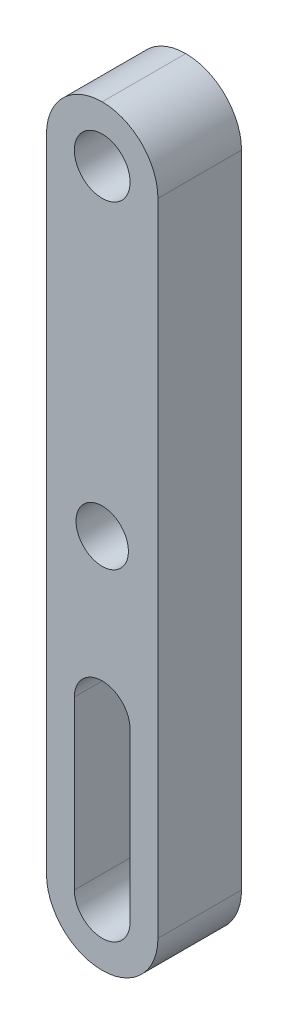
ISO-10303-21;
HEADER;
FILE_DESCRIPTION(('STEP AP214'),'2;1');
FILE_NAME('part.step','',(''),(''),'','','');
FILE_SCHEMA(('AUTOMOTIVE_DESIGN { 1 0 10303 214 1 1 1 1 }'));
ENDSEC;
DATA;
#1=APPLICATION_CONTEXT('core data for automotive mechanical design processes');
#2=APPLICATION_PROTOCOL_DEFINITION('international standard','automotive_design',2000,#1);
#3=PRODUCT_CONTEXT('',#1,'mechanical');
#4=PRODUCT('Part','Part','',(#3));
#5=PRODUCT_RELATED_PRODUCT_CATEGORY('part','',(#4));
#6=PRODUCT_DEFINITION_FORMATION('','',#4);
#7=PRODUCT_DEFINITION_CONTEXT('part definition',#1,'design');
#8=PRODUCT_DEFINITION('design','',#6,#7);
#9=PRODUCT_DEFINITION_SHAPE('','',#8);
#10=(LENGTH_UNIT() NAMED_UNIT(*) SI_UNIT(.MILLI.,.METRE.));
#11=(NAMED_UNIT(*) PLANE_ANGLE_UNIT() SI_UNIT($,.RADIAN.));
#12=(NAMED_UNIT(*) SI_UNIT($,.STERADIAN.) SOLID_ANGLE_UNIT());
#13=UNCERTAINTY_MEASURE_WITH_UNIT(LENGTH_MEASURE(1.E-05),#10,'distance_accuracy_value','');
#14=(GEOMETRIC_REPRESENTATION_CONTEXT(3) GLOBAL_UNCERTAINTY_ASSIGNED_CONTEXT((#13)) GLOBAL_UNIT_ASSIGNED_CONTEXT((#10,
#11,#12)) REPRESENTATION_CONTEXT('',''));
#15=CARTESIAN_POINT('',(0.,0.,0.));
#16=DIRECTION('',(0.,0.,1.));
#17=DIRECTION('',(1.,0.,0.));
#18=AXIS2_PLACEMENT_3D('',#15,#16,#17);
#19=CARTESIAN_POINT('',(-3.17500000000003,21.4312500000002,4.76249999999993));
#20=DIRECTION('',(1.00000000000001,0.,0.));
#21=DIRECTION('',(0.,0.,-1.));
#22=AXIS2_PLACEMENT_3D('',#19,#20,#21);
#23=PLANE('',#22);
#24=DIRECTION('',(0.,-1.00000000000001,0.));
#25=VECTOR('',#24,1.);
#26=CARTESIAN_POINT('',(-3.175,21.4312500000001,2.35922392732846E-13));
#27=LINE('',#26,#25);
#28=CARTESIAN_POINT('',(-3.17500000000004,18.25625,2.70616862252382E-13));
#29=VERTEX_POINT('',#28);
#30=CARTESIAN_POINT('',(-3.17500000000016,-18.2562500000003,1.38777878078145E-13));
#31=VERTEX_POINT('',#30);
#32=EDGE_CURVE('E184',#29,#31,#27,.T.);
#33=ORIENTED_EDGE('',*,*,#32,.T.);
#34=DIRECTION('',(0.,0.,-1.));
#35=VECTOR('',#34,1.);
#36=CARTESIAN_POINT('',(-3.17500000000018,-18.2562500000002,4.76249999999984));
#37=LINE('',#36,#35);
#38=CARTESIAN_POINT('',(-3.17500000000018,-18.2562500000002,4.76249999999984));
#39=VERTEX_POINT('',#38);
#40=EDGE_CURVE('E217',#31,#39,#37,.F.);
#41=ORIENTED_EDGE('',*,*,#40,.T.);
#42=DIRECTION('',(0.,-1.00000000000001,0.));
#43=VECTOR('',#42,1.);
#44=CARTESIAN_POINT('',(-3.17500000000003,21.4312500000002,4.76249999999993));
#45=LINE('',#44,#43);
#46=CARTESIAN_POINT('',(-3.17500000000004,18.2562500000002,4.76249999999997));
#47=VERTEX_POINT('',#46);
#48=EDGE_CURVE('E188',#47,#39,#45,.T.);
#49=ORIENTED_EDGE('',*,*,#48,.F.);
#50=DIRECTION('',(0.,0.,-1.));
#51=VECTOR('',#50,1.);
#52=CARTESIAN_POINT('',(-3.17500000000004,18.2562500000002,4.76249999999997));
#53=LINE('',#52,#51);
#54=EDGE_CURVE('E213',#47,#29,#53,.T.);
#55=ORIENTED_EDGE('',*,*,#54,.T.);
#56=EDGE_LOOP('',(#33,#41,#49,#55));
#57=FACE_BOUND('',#56,.T.);
#58=ADVANCED_FACE('F34',(#57),#23,.F.);
#59=CARTESIAN_POINT('',(3.17500000000005,21.4312500000002,4.76249999999997));
#60=DIRECTION('',(-1.00000000000001,0.,0.));
#61=DIRECTION('',(0.,0.,1.));
#62=AXIS2_PLACEMENT_3D('',#59,#60,#61);
#63=PLANE('',#62);
#64=DIRECTION('',(0.,1.00000000000001,0.));
#65=VECTOR('',#64,1.);
#66=CARTESIAN_POINT('',(3.17500000000005,21.4312500000002,4.76249999999997));
#67=LINE('',#66,#65);
#68=CARTESIAN_POINT('',(3.17499999999998,-18.2562500000002,4.76250000000029));
#69=VERTEX_POINT('',#68);
#70=CARTESIAN_POINT('',(3.17500000000003,18.2562500000003,4.76250000000007));
#71=VERTEX_POINT('',#70);
#72=EDGE_CURVE('E192',#69,#71,#67,.T.);
#73=ORIENTED_EDGE('',*,*,#72,.F.);
#74=DIRECTION('',(0.,0.,-1.));
#75=VECTOR('',#74,1.);
#76=CARTESIAN_POINT('',(3.17499999999998,-18.2562500000002,4.76250000000029));
#77=LINE('',#76,#75);
#78=CARTESIAN_POINT('',(3.17499999999998,-18.2562500000003,-2.28983498828939E-13));
#79=VERTEX_POINT('',#78);
#80=EDGE_CURVE('E11',#69,#79,#77,.T.);
#81=ORIENTED_EDGE('',*,*,#80,.T.);
#82=DIRECTION('',(0.,1.00000000000001,0.));
#83=VECTOR('',#82,1.);
#84=CARTESIAN_POINT('',(3.17500000000019,21.4312500000002,0.));
#85=LINE('',#84,#83);
#86=CARTESIAN_POINT('',(3.17500000000009,18.2562500000002,1.73472347597681E-13));
#87=VERTEX_POINT('',#86);
#88=EDGE_CURVE('E193',#79,#87,#85,.T.);
#89=ORIENTED_EDGE('',*,*,#88,.T.);
#90=DIRECTION('',(0.,0.,-1.));
#91=VECTOR('',#90,1.);
#92=CARTESIAN_POINT('',(3.17500000000003,18.2562500000003,4.76250000000007));
#93=LINE('',#92,#91);
#94=EDGE_CURVE('E44',#87,#71,#93,.F.);
#95=ORIENTED_EDGE('',*,*,#94,.T.);
#96=EDGE_LOOP('',(#73,#81,#89,#95));
#97=FACE_BOUND('',#96,.T.);
#98=ADVANCED_FACE('F252',(#97),#63,.F.);
#99=CARTESIAN_POINT('',(0.,0.,4.76250000000016));
#100=DIRECTION('',(0.,0.,1.));
#101=DIRECTION('',(1.00000000000001,0.,0.));
#102=AXIS2_PLACEMENT_3D('',#99,#100,#101);
#103=PLANE('',#102);
#104=CARTESIAN_POINT('',(-1.80411241501588E-13,-18.2562500000003,4.76250000000007));
#105=DIRECTION('',(0.,0.,1.));
#106=DIRECTION('',(1.00000000000001,0.,0.));
#107=AXIS2_PLACEMENT_3D('',#104,#105,#106);
#108=CIRCLE('',#107,1.5875);
#109=CARTESIAN_POINT('',(-1.58750000000013,-18.2562500000002,4.76250000000002));
#110=VERTEX_POINT('',#109);
#111=CARTESIAN_POINT('',(1.58749999999989,-18.2562500000002,4.76249999999994));
#112=VERTEX_POINT('',#111);
#113=EDGE_CURVE('E121',#110,#112,#108,.T.);
#114=ORIENTED_EDGE('',*,*,#113,.F.);
#115=DIRECTION('',(0.,-1.00000000000001,0.));
#116=VECTOR('',#115,1.);
#117=CARTESIAN_POINT('',(-1.58750000000013,-18.2562500000002,4.76250000000002));
#118=LINE('',#117,#116);
#119=CARTESIAN_POINT('',(-1.58750000000006,-8.73125000000008,4.76250000000018));
#120=VERTEX_POINT('',#119);
#121=EDGE_CURVE('E142',#120,#110,#118,.T.);
#122=ORIENTED_EDGE('',*,*,#121,.F.);
#123=CARTESIAN_POINT('',(0.,-8.73125000000009,4.76250000000025));
#124=DIRECTION('',(0.,0.,1.));
#125=DIRECTION('',(-1.00000000000001,0.,0.));
#126=AXIS2_PLACEMENT_3D('',#123,#124,#125);
#127=CIRCLE('',#126,1.5875);
#128=CARTESIAN_POINT('',(1.58749999999996,-8.73125000000005,4.76250000000004));
#129=VERTEX_POINT('',#128);
#130=EDGE_CURVE('E147',#129,#120,#127,.T.);
#131=ORIENTED_EDGE('',*,*,#130,.F.);
#132=DIRECTION('',(0.,1.00000000000001,0.));
#133=VECTOR('',#132,1.);
#134=CARTESIAN_POINT('',(1.58749999999989,-18.2562500000002,4.76249999999994));
#135=LINE('',#134,#133);
#136=EDGE_CURVE('E156',#112,#129,#135,.T.);
#137=ORIENTED_EDGE('',*,*,#136,.F.);
#138=EDGE_LOOP('',(#114,#122,#131,#137));
#139=FACE_BOUND('',#138,.T.);
#140=CARTESIAN_POINT('',(0.,18.2562500000002,4.76249999999984));
#141=DIRECTION('',(0.,0.,1.));
#142=DIRECTION('',(1.00000000000001,0.,0.));
#143=AXIS2_PLACEMENT_3D('',#140,#141,#142);
#144=CIRCLE('',#143,1.5875);
#145=CARTESIAN_POINT('',(1.5875000000001,18.2562500000001,4.76249999999984));
#146=VERTEX_POINT('',#145);
#147=EDGE_CURVE('E166',#146,#146,#144,.T.);
#148=ORIENTED_EDGE('',*,*,#147,.F.);
#149=EDGE_LOOP('',(#148));
#150=FACE_BOUND('',#149,.T.);
#151=CARTESIAN_POINT('',(0.,0.,4.76250000000016));
#152=DIRECTION('',(0.,0.,1.));
#153=DIRECTION('',(1.00000000000001,0.,0.));
#154=AXIS2_PLACEMENT_3D('',#151,#152,#153);
#155=CIRCLE('',#154,1.49225);
#156=CARTESIAN_POINT('',(1.49225000000002,0.,4.76250000000016));
#157=VERTEX_POINT('',#156);
#158=EDGE_CURVE('E176',#157,#157,#155,.T.);
#159=ORIENTED_EDGE('',*,*,#158,.F.);
#160=EDGE_LOOP('',(#159));
#161=FACE_BOUND('',#160,.T.);
#162=ORIENTED_EDGE('',*,*,#48,.T.);
#163=CARTESIAN_POINT('',(-1.80411241501588E-13,-18.2562500000003,4.76250000000007));
#164=DIRECTION('',(0.,0.,1.));
#165=DIRECTION('',(1.00000000000001,0.,0.));
#166=AXIS2_PLACEMENT_3D('',#163,#164,#165);
#167=CIRCLE('',#166,3.175);
#168=CARTESIAN_POINT('',(-1.38777878078145E-13,-21.4312500000002,4.7624999999999));
#169=VERTEX_POINT('',#168);
#170=EDGE_CURVE('E229',#39,#169,#167,.T.);
#171=ORIENTED_EDGE('',*,*,#170,.T.);
#172=CARTESIAN_POINT('',(-1.80411241501588E-13,-18.2562500000003,4.76250000000007));
#173=DIRECTION('',(0.,0.,1.));
#174=DIRECTION('',(1.00000000000001,0.,0.));
#175=AXIS2_PLACEMENT_3D('',#172,#173,#174);
#176=CIRCLE('',#175,3.175);
#177=EDGE_CURVE('E226',#169,#69,#176,.T.);
#178=ORIENTED_EDGE('',*,*,#177,.T.);
#179=ORIENTED_EDGE('',*,*,#72,.T.);
#180=CARTESIAN_POINT('',(0.,18.2562500000002,4.76249999999984));
#181=DIRECTION('',(0.,0.,1.));
#182=DIRECTION('',(1.00000000000001,0.,0.));
#183=AXIS2_PLACEMENT_3D('',#180,#181,#182);
#184=CIRCLE('',#183,3.175);
#185=CARTESIAN_POINT('',(0.,21.4312500000003,4.76250000000002));
#186=VERTEX_POINT('',#185);
#187=EDGE_CURVE('E52',#71,#186,#184,.T.);
#188=ORIENTED_EDGE('',*,*,#187,.T.);
#189=CARTESIAN_POINT('',(0.,18.2562500000002,4.76249999999984));
#190=DIRECTION('',(0.,0.,1.));
#191=DIRECTION('',(1.00000000000001,0.,0.));
#192=AXIS2_PLACEMENT_3D('',#189,#190,#191);
#193=CIRCLE('',#192,3.175);
#194=EDGE_CURVE('E223',#186,#47,#193,.T.);
#195=ORIENTED_EDGE('',*,*,#194,.T.);
#196=EDGE_LOOP('',(#162,#171,#178,#179,#188,#195));
#197=FACE_BOUND('',#196,.T.);
#198=ADVANCED_FACE('F261',(#139,#150,#161,#197),#103,.T.);
#199=CARTESIAN_POINT('',(0.,0.,0.));
#200=DIRECTION('',(0.,0.,1.));
#201=DIRECTION('',(1.00000000000001,0.,0.));
#202=AXIS2_PLACEMENT_3D('',#199,#200,#201);
#203=PLANE('',#202);
#204=DIRECTION('',(0.,-1.00000000000001,0.));
#205=VECTOR('',#204,1.);
#206=CARTESIAN_POINT('',(-1.58750000000012,-18.2562500000002,1.45716771982052E-13));
#207=LINE('',#206,#205);
#208=CARTESIAN_POINT('',(-1.58750000000009,-8.73125000000016,0.));
#209=VERTEX_POINT('',#208);
#210=CARTESIAN_POINT('',(-1.58750000000012,-18.2562500000002,1.45716771982052E-13));
#211=VERTEX_POINT('',#210);
#212=EDGE_CURVE('E127',#209,#211,#207,.T.);
#213=ORIENTED_EDGE('',*,*,#212,.T.);
#214=CARTESIAN_POINT('',(0.,-18.2562500000003,1.45716771982052E-13));
#215=DIRECTION('',(0.,0.,1.));
#216=DIRECTION('',(1.00000000000001,0.,0.));
#217=AXIS2_PLACEMENT_3D('',#214,#215,#216);
#218=CIRCLE('',#217,1.5875);
#219=CARTESIAN_POINT('',(1.58749999999999,-18.2562500000003,0.));
#220=VERTEX_POINT('',#219);
#221=EDGE_CURVE('E118',#211,#220,#218,.T.);
#222=ORIENTED_EDGE('',*,*,#221,.T.);
#223=DIRECTION('',(0.,1.00000000000001,0.));
#224=VECTOR('',#223,1.);
#225=CARTESIAN_POINT('',(1.58749999999999,-18.2562500000003,0.));
#226=LINE('',#225,#224);
#227=CARTESIAN_POINT('',(1.58749999999996,-8.7312500000002,0.));
#228=VERTEX_POINT('',#227);
#229=EDGE_CURVE('E131',#220,#228,#226,.T.);
#230=ORIENTED_EDGE('',*,*,#229,.T.);
#231=CARTESIAN_POINT('',(0.,-8.7312500000002,-2.28983498828939E-13));
#232=DIRECTION('',(0.,0.,1.));
#233=DIRECTION('',(-1.00000000000001,0.,0.));
#234=AXIS2_PLACEMENT_3D('',#231,#232,#233);
#235=CIRCLE('',#234,1.5875);
#236=EDGE_CURVE('E136',#228,#209,#235,.T.);
#237=ORIENTED_EDGE('',*,*,#236,.T.);
#238=EDGE_LOOP('',(#213,#222,#230,#237));
#239=FACE_BOUND('',#238,.T.);
#240=CARTESIAN_POINT('',(0.,18.2562500000001,3.7470027081099E-13));
#241=DIRECTION('',(0.,0.,1.));
#242=DIRECTION('',(1.00000000000001,0.,0.));
#243=AXIS2_PLACEMENT_3D('',#240,#241,#242);
#244=CIRCLE('',#243,1.5875);
#245=CARTESIAN_POINT('',(1.5875000000001,18.2562500000001,3.74700270801866E-13));
#246=VERTEX_POINT('',#245);
#247=EDGE_CURVE('E172',#246,#246,#244,.T.);
#248=ORIENTED_EDGE('',*,*,#247,.T.);
#249=EDGE_LOOP('',(#248));
#250=FACE_BOUND('',#249,.T.);
#251=CARTESIAN_POINT('',(0.,0.,0.));
#252=DIRECTION('',(0.,0.,1.));
#253=DIRECTION('',(1.00000000000001,0.,0.));
#254=AXIS2_PLACEMENT_3D('',#251,#252,#253);
#255=CIRCLE('',#254,1.49225);
#256=CARTESIAN_POINT('',(1.49225000000002,0.,0.));
#257=VERTEX_POINT('',#256);
#258=EDGE_CURVE('E180',#257,#257,#255,.T.);
#259=ORIENTED_EDGE('',*,*,#258,.T.);
#260=EDGE_LOOP('',(#259));
#261=FACE_BOUND('',#260,.T.);
#262=CARTESIAN_POINT('',(0.,-18.2562500000003,1.45716771982052E-13));
#263=DIRECTION('',(0.,0.,1.));
#264=DIRECTION('',(1.00000000000001,0.,0.));
#265=AXIS2_PLACEMENT_3D('',#262,#263,#264);
#266=CIRCLE('',#265,3.175);
#267=CARTESIAN_POINT('',(0.,-21.4312500000003,0.));
#268=VERTEX_POINT('',#267);
#269=EDGE_CURVE('E207',#79,#268,#266,.F.);
#270=ORIENTED_EDGE('',*,*,#269,.T.);
#271=CARTESIAN_POINT('',(0.,-18.2562500000003,1.45716771982052E-13));
#272=DIRECTION('',(0.,0.,1.));
#273=DIRECTION('',(1.00000000000001,0.,0.));
#274=AXIS2_PLACEMENT_3D('',#271,#272,#273);
#275=CIRCLE('',#274,3.175);
#276=EDGE_CURVE('E210',#268,#31,#275,.F.);
#277=ORIENTED_EDGE('',*,*,#276,.T.);
#278=ORIENTED_EDGE('',*,*,#32,.F.);
#279=CARTESIAN_POINT('',(0.,18.2562500000001,3.7470027081099E-13));
#280=DIRECTION('',(0.,0.,1.));
#281=DIRECTION('',(1.00000000000001,0.,0.));
#282=AXIS2_PLACEMENT_3D('',#279,#280,#281);
#283=CIRCLE('',#282,3.175);
#284=CARTESIAN_POINT('',(0.,21.43125,2.22044604925031E-13));
#285=VERTEX_POINT('',#284);
#286=EDGE_CURVE('E204',#29,#285,#283,.F.);
#287=ORIENTED_EDGE('',*,*,#286,.T.);
#288=CARTESIAN_POINT('',(0.,18.2562500000001,3.7470027081099E-13));
#289=DIRECTION('',(0.,0.,1.));
#290=DIRECTION('',(1.00000000000001,0.,0.));
#291=AXIS2_PLACEMENT_3D('',#288,#289,#290);
#292=CIRCLE('',#291,3.175);
#293=EDGE_CURVE('E196',#285,#87,#292,.F.);
#294=ORIENTED_EDGE('',*,*,#293,.T.);
#295=ORIENTED_EDGE('',*,*,#88,.F.);
#296=EDGE_LOOP('',(#270,#277,#278,#287,#294,#295));
#297=FACE_BOUND('',#296,.T.);
#298=ADVANCED_FACE('F138',(#239,#250,#261,#297),#203,.F.);
#299=CARTESIAN_POINT('',(0.,0.,0.));
#300=DIRECTION('',(0.,0.,1.));
#301=DIRECTION('',(1.00000000000001,0.,0.));
#302=AXIS2_PLACEMENT_3D('',#299,#300,#301);
#303=CYLINDRICAL_SURFACE('',#302,1.49225);
#304=CARTESIAN_POINT('',(1.49225000000002,0.,0.));
#305=CARTESIAN_POINT('',(1.49225000000002,0.,0.0496093750000017));
#306=CARTESIAN_POINT('',(1.49225000000002,0.,0.0992187500000034));
#307=CARTESIAN_POINT('',(1.49225000000002,0.,0.198437500000007));
#308=CARTESIAN_POINT('',(1.49225000000002,0.,0.248046875000008));
#309=CARTESIAN_POINT('',(1.49225000000002,0.,0.347265625000012));
#310=CARTESIAN_POINT('',(1.49225000000002,0.,0.396875000000013));
#311=CARTESIAN_POINT('',(1.49225000000002,0.,0.496093750000017));
#312=CARTESIAN_POINT('',(1.49225000000002,0.,0.545703125000018));
#313=CARTESIAN_POINT('',(1.49225000000002,0.,0.644921875000022));
#314=CARTESIAN_POINT('',(1.49225000000002,0.,0.694531250000024));
#315=CARTESIAN_POINT('',(1.49225000000002,0.,0.793750000000027));
#316=CARTESIAN_POINT('',(1.49225000000002,0.,0.843359375000029));
#317=CARTESIAN_POINT('',(1.49225000000002,0.,0.942578125000032));
#318=CARTESIAN_POINT('',(1.49225000000002,0.,0.992187500000034));
#319=CARTESIAN_POINT('',(1.49225000000002,0.,1.09140625000004));
#320=CARTESIAN_POINT('',(1.49225000000002,0.,1.14101562500004));
#321=CARTESIAN_POINT('',(1.49225000000002,0.,1.24023437500004));
#322=CARTESIAN_POINT('',(1.49225000000002,0.,1.28984375000004));
#323=CARTESIAN_POINT('',(1.49225000000002,0.,1.38906250000005));
#324=CARTESIAN_POINT('',(1.49225000000002,0.,1.43867187500005));
#325=CARTESIAN_POINT('',(1.49225000000002,0.,1.53789062500005));
#326=CARTESIAN_POINT('',(1.49225000000002,0.,1.58750000000005));
#327=CARTESIAN_POINT('',(1.49225000000002,0.,1.68671875000006));
#328=CARTESIAN_POINT('',(1.49225000000002,0.,1.73632812500006));
#329=CARTESIAN_POINT('',(1.49225000000002,0.,1.83554687500006));
#330=CARTESIAN_POINT('',(1.49225000000002,0.,1.88515625000006));
#331=CARTESIAN_POINT('',(1.49225000000002,0.,1.98437500000007));
#332=CARTESIAN_POINT('',(1.49225000000002,0.,2.03398437500007));
#333=CARTESIAN_POINT('',(1.49225000000002,0.,2.13320312500007));
#334=CARTESIAN_POINT('',(1.49225000000002,0.,2.18281250000007));
#335=CARTESIAN_POINT('',(1.49225000000002,0.,2.28203125000008));
#336=CARTESIAN_POINT('',(1.49225000000002,0.,2.33164062500008));
#337=CARTESIAN_POINT('',(1.49225000000002,0.,2.43085937500008));
#338=CARTESIAN_POINT('',(1.49225000000002,0.,2.48046875000008));
#339=CARTESIAN_POINT('',(1.49225000000002,0.,2.57968750000009));
#340=CARTESIAN_POINT('',(1.49225000000002,0.,2.62929687500009));
#341=CARTESIAN_POINT('',(1.49225000000002,0.,2.72851562500009));
#342=CARTESIAN_POINT('',(1.49225000000002,0.,2.77812500000009));
#343=CARTESIAN_POINT('',(1.49225000000002,0.,2.8773437500001));
#344=CARTESIAN_POINT('',(1.49225000000002,0.,2.9269531250001));
#345=CARTESIAN_POINT('',(1.49225000000002,0.,3.0261718750001));
#346=CARTESIAN_POINT('',(1.49225000000002,0.,3.0757812500001));
#347=CARTESIAN_POINT('',(1.49225000000002,0.,3.17500000000011));
#348=CARTESIAN_POINT('',(1.49225000000002,0.,3.22460937500011));
#349=CARTESIAN_POINT('',(1.49225000000002,0.,3.32382812500011));
#350=CARTESIAN_POINT('',(1.49225000000002,0.,3.37343750000011));
#351=CARTESIAN_POINT('',(1.49225000000002,0.,3.47265625000012));
#352=CARTESIAN_POINT('',(1.49225000000002,0.,3.52226562500012));
#353=CARTESIAN_POINT('',(1.49225000000002,0.,3.62148437500012));
#354=CARTESIAN_POINT('',(1.49225000000002,0.,3.67109375000012));
#355=CARTESIAN_POINT('',(1.49225000000002,0.,3.77031250000013));
#356=CARTESIAN_POINT('',(1.49225000000002,0.,3.81992187500013));
#357=CARTESIAN_POINT('',(1.49225000000002,0.,3.91914062500013));
#358=CARTESIAN_POINT('',(1.49225000000002,0.,3.96875000000013));
#359=CARTESIAN_POINT('',(1.49225000000002,0.,4.06796875000014));
#360=CARTESIAN_POINT('',(1.49225000000002,0.,4.11757812500014));
#361=CARTESIAN_POINT('',(1.49225000000002,0.,4.21679687500014));
#362=CARTESIAN_POINT('',(1.49225000000002,0.,4.26640625000014));
#363=CARTESIAN_POINT('',(1.49225000000002,0.,4.36562500000015));
#364=CARTESIAN_POINT('',(1.49225000000002,0.,4.41523437500015));
#365=CARTESIAN_POINT('',(1.49225000000002,0.,4.51445312500015));
#366=CARTESIAN_POINT('',(1.49225000000002,0.,4.56406250000015));
#367=CARTESIAN_POINT('',(1.49225000000002,0.,4.66328125000016));
#368=CARTESIAN_POINT('',(1.49225000000002,0.,4.71289062500016));
#369=CARTESIAN_POINT('',(1.49225000000002,0.,4.76250000000016));
#370=B_SPLINE_CURVE_WITH_KNOTS('',3,(#304,#305,#306,#307,#308,#309,#310,#311,#312,#313,#314,
#315,#316,#317,#318,#319,#320,#321,#322,#323,#324,#325,#326,#327,#328,#329,#330,#331,#332,#333,
#334,#335,#336,#337,#338,#339,#340,#341,#342,#343,#344,#345,#346,#347,#348,#349,#350,#351,#352,
#353,#354,#355,#356,#357,#358,#359,#360,#361,#362,#363,#364,#365,#366,#367,#368,#369),
.UNSPECIFIED.,.F.,.F.,(4,2,2,2,2,2,2,2,2,2,2,2,2,2,2,2,2,2,2,2,2,2,2,2,2,2,2,2,2,2,2,2,4),(0.,
0.148828125000005,0.29765625000001,0.446484375000015,0.59531250000002,0.744140625000025,
0.89296875000003,1.04179687500004,1.19062500000004,1.33945312500005,1.48828125000005,
1.63710937500006,1.78593750000006,1.93476562500007,2.08359375000007,2.23242187500008,
2.38125000000008,2.53007812500009,2.67890625000009,2.8277343750001,2.9765625000001,
3.12539062500011,3.27421875000011,3.42304687500012,3.57187500000012,3.72070312500013,
3.86953125000013,4.01835937500014,4.16718750000014,4.31601562500015,4.46484375000015,
4.61367187500016,4.76250000000016),.UNSPECIFIED.);
#371=EDGE_CURVE('BSEAM269',#257,#157,#370,.T.);
#372=ORIENTED_EDGE('',*,*,#258,.F.);
#373=ORIENTED_EDGE('',*,*,#158,.T.);
#374=ORIENTED_EDGE('',*,*,#371,.T.);
#375=ORIENTED_EDGE('',*,*,#371,.F.);
#376=EDGE_LOOP('',(#372,#374,#373,#375));
#377=FACE_BOUND('',#376,.T.);
#378=ADVANCED_FACE('F269',(#377),#303,.F.);
#379=CARTESIAN_POINT('',(0.,18.2562500000001,3.7470027081099E-13));
#380=DIRECTION('',(0.,0.,1.));
#381=DIRECTION('',(1.00000000000001,0.,0.));
#382=AXIS2_PLACEMENT_3D('',#379,#380,#381);
#383=CYLINDRICAL_SURFACE('',#382,1.5875);
#384=CARTESIAN_POINT('',(1.5875000000001,18.2562500000001,3.74700270801866E-13));
#385=CARTESIAN_POINT('',(1.5875000000001,18.2562500000001,0.0496093750003692));
#386=CARTESIAN_POINT('',(1.5875000000001,18.2562500000001,0.0992187500003636));
#387=CARTESIAN_POINT('',(1.5875000000001,18.2562500000001,0.198437500000352));
#388=CARTESIAN_POINT('',(1.5875000000001,18.2562500000001,0.248046875000347));
#389=CARTESIAN_POINT('',(1.5875000000001,18.2562500000001,0.347265625000336));
#390=CARTESIAN_POINT('',(1.5875000000001,18.2562500000001,0.39687500000033));
#391=CARTESIAN_POINT('',(1.5875000000001,18.2562500000001,0.496093750000319));
#392=CARTESIAN_POINT('',(1.5875000000001,18.2562500000001,0.545703125000314));
#393=CARTESIAN_POINT('',(1.5875000000001,18.2562500000001,0.644921875000303));
#394=CARTESIAN_POINT('',(1.5875000000001,18.2562500000001,0.694531250000297));
#395=CARTESIAN_POINT('',(1.5875000000001,18.2562500000001,0.793750000000286));
#396=CARTESIAN_POINT('',(1.5875000000001,18.2562500000001,0.84335937500028));
#397=CARTESIAN_POINT('',(1.5875000000001,18.2562500000001,0.942578125000269));
#398=CARTESIAN_POINT('',(1.5875000000001,18.2562500000001,0.992187500000264));
#399=CARTESIAN_POINT('',(1.5875000000001,18.2562500000001,1.09140625000025));
#400=CARTESIAN_POINT('',(1.5875000000001,18.2562500000001,1.14101562500025));
#401=CARTESIAN_POINT('',(1.5875000000001,18.2562500000001,1.24023437500024));
#402=CARTESIAN_POINT('',(1.5875000000001,18.2562500000001,1.28984375000023));
#403=CARTESIAN_POINT('',(1.5875000000001,18.2562500000001,1.38906250000022));
#404=CARTESIAN_POINT('',(1.5875000000001,18.2562500000001,1.43867187500021));
#405=CARTESIAN_POINT('',(1.5875000000001,18.2562500000001,1.5378906250002));
#406=CARTESIAN_POINT('',(1.5875000000001,18.2562500000001,1.5875000000002));
#407=CARTESIAN_POINT('',(1.5875000000001,18.2562500000001,1.68671875000019));
#408=CARTESIAN_POINT('',(1.5875000000001,18.2562500000001,1.73632812500018));
#409=CARTESIAN_POINT('',(1.5875000000001,18.2562500000001,1.83554687500017));
#410=CARTESIAN_POINT('',(1.5875000000001,18.2562500000001,1.88515625000016));
#411=CARTESIAN_POINT('',(1.5875000000001,18.2562500000001,1.98437500000015));
#412=CARTESIAN_POINT('',(1.5875000000001,18.2562500000001,2.03398437500015));
#413=CARTESIAN_POINT('',(1.5875000000001,18.2562500000001,2.13320312500014));
#414=CARTESIAN_POINT('',(1.5875000000001,18.2562500000001,2.18281250000013));
#415=CARTESIAN_POINT('',(1.5875000000001,18.2562500000001,2.28203125000012));
#416=CARTESIAN_POINT('',(1.5875000000001,18.2562500000001,2.33164062500011));
#417=CARTESIAN_POINT('',(1.5875000000001,18.2562500000001,2.4308593750001));
#418=CARTESIAN_POINT('',(1.5875000000001,18.2562500000001,2.4804687500001));
#419=CARTESIAN_POINT('',(1.5875000000001,18.2562500000001,2.57968750000009));
#420=CARTESIAN_POINT('',(1.5875000000001,18.2562500000001,2.62929687500008));
#421=CARTESIAN_POINT('',(1.5875000000001,18.2562500000001,2.72851562500007));
#422=CARTESIAN_POINT('',(1.5875000000001,18.2562500000001,2.77812500000006));
#423=CARTESIAN_POINT('',(1.5875000000001,18.2562500000001,2.87734375000005));
#424=CARTESIAN_POINT('',(1.5875000000001,18.2562500000001,2.92695312500005));
#425=CARTESIAN_POINT('',(1.5875000000001,18.2562500000001,3.02617187500004));
#426=CARTESIAN_POINT('',(1.5875000000001,18.2562500000001,3.07578125000003));
#427=CARTESIAN_POINT('',(1.5875000000001,18.2562500000001,3.17500000000002));
#428=CARTESIAN_POINT('',(1.5875000000001,18.2562500000001,3.22460937500001));
#429=CARTESIAN_POINT('',(1.5875000000001,18.2562500000001,3.323828125));
#430=CARTESIAN_POINT('',(1.5875000000001,18.2562500000001,3.3734375));
#431=CARTESIAN_POINT('',(1.5875000000001,18.2562500000001,3.47265624999999));
#432=CARTESIAN_POINT('',(1.5875000000001,18.2562500000001,3.52226562499998));
#433=CARTESIAN_POINT('',(1.5875000000001,18.2562500000001,3.62148437499997));
#434=CARTESIAN_POINT('',(1.5875000000001,18.2562500000001,3.67109374999996));
#435=CARTESIAN_POINT('',(1.5875000000001,18.2562500000001,3.77031249999995));
#436=CARTESIAN_POINT('',(1.5875000000001,18.2562500000001,3.81992187499995));
#437=CARTESIAN_POINT('',(1.5875000000001,18.2562500000001,3.91914062499994));
#438=CARTESIAN_POINT('',(1.5875000000001,18.2562500000001,3.96874999999993));
#439=CARTESIAN_POINT('',(1.5875000000001,18.2562500000001,4.06796874999992));
#440=CARTESIAN_POINT('',(1.5875000000001,18.2562500000001,4.11757812499991));
#441=CARTESIAN_POINT('',(1.5875000000001,18.2562500000001,4.2167968749999));
#442=CARTESIAN_POINT('',(1.5875000000001,18.2562500000001,4.2664062499999));
#443=CARTESIAN_POINT('',(1.5875000000001,18.2562500000001,4.36562499999989));
#444=CARTESIAN_POINT('',(1.5875000000001,18.2562500000001,4.41523437499988));
#445=CARTESIAN_POINT('',(1.5875000000001,18.2562500000001,4.51445312499987));
#446=CARTESIAN_POINT('',(1.5875000000001,18.2562500000001,4.56406249999986));
#447=CARTESIAN_POINT('',(1.5875000000001,18.2562500000001,4.66328124999985));
#448=CARTESIAN_POINT('',(1.5875000000001,18.2562500000001,4.71289062499985));
#449=CARTESIAN_POINT('',(1.5875000000001,18.2562500000001,4.76249999999984));
#450=B_SPLINE_CURVE_WITH_KNOTS('',3,(#384,#385,#386,#387,#388,#389,#390,#391,#392,#393,#394,
#395,#396,#397,#398,#399,#400,#401,#402,#403,#404,#405,#406,#407,#408,#409,#410,#411,#412,#413,
#414,#415,#416,#417,#418,#419,#420,#421,#422,#423,#424,#425,#426,#427,#428,#429,#430,#431,#432,
#433,#434,#435,#436,#437,#438,#439,#440,#441,#442,#443,#444,#445,#446,#447,#448,#449),
.UNSPECIFIED.,.F.,.F.,(4,2,2,2,2,2,2,2,2,2,2,2,2,2,2,2,2,2,2,2,2,2,2,2,2,2,2,2,2,2,2,2,4),(0.,
0.148828124999983,0.297656249999967,0.44648437499995,0.595312499999933,0.744140624999917,
0.8929687499999,1.04179687499988,1.19062499999987,1.33945312499985,1.48828124999983,
1.63710937499982,1.7859374999998,1.93476562499978,2.08359374999977,2.23242187499975,
2.38124999999973,2.53007812499972,2.6789062499997,2.82773437499968,2.97656249999967,
3.12539062499965,3.27421874999963,3.42304687499962,3.5718749999996,3.72070312499958,
3.86953124999957,4.01835937499955,4.16718749999953,4.31601562499952,4.4648437499995,
4.61367187499948,4.76249999999947),.UNSPECIFIED.);
#451=EDGE_CURVE('BSEAM324',#246,#146,#450,.T.);
#452=ORIENTED_EDGE('',*,*,#247,.F.);
#453=ORIENTED_EDGE('',*,*,#147,.T.);
#454=ORIENTED_EDGE('',*,*,#451,.T.);
#455=ORIENTED_EDGE('',*,*,#451,.F.);
#456=EDGE_LOOP('',(#452,#454,#453,#455));
#457=FACE_BOUND('',#456,.T.);
#458=ADVANCED_FACE('F324',(#457),#383,.F.);
#459=CARTESIAN_POINT('',(0.,-18.2562500000003,1.45716771982052E-13));
#460=DIRECTION('',(0.,0.,1.));
#461=DIRECTION('',(1.00000000000001,0.,0.));
#462=AXIS2_PLACEMENT_3D('',#459,#460,#461);
#463=CYLINDRICAL_SURFACE('',#462,1.5875);
#464=ORIENTED_EDGE('',*,*,#113,.T.);
#465=DIRECTION('',(0.,0.,1.));
#466=VECTOR('',#465,1.);
#467=CARTESIAN_POINT('',(1.58749999999999,-18.2562500000003,0.));
#468=LINE('',#467,#466);
#469=EDGE_CURVE('E114',#220,#112,#468,.T.);
#470=ORIENTED_EDGE('',*,*,#469,.F.);
#471=ORIENTED_EDGE('',*,*,#221,.F.);
#472=DIRECTION('',(0.,0.,1.));
#473=VECTOR('',#472,1.);
#474=CARTESIAN_POINT('',(-1.58750000000012,-18.2562500000002,1.45716771982052E-13));
#475=LINE('',#474,#473);
#476=EDGE_CURVE('E163',#211,#110,#475,.T.);
#477=ORIENTED_EDGE('',*,*,#476,.T.);
#478=EDGE_LOOP('',(#464,#470,#471,#477));
#479=FACE_BOUND('',#478,.T.);
#480=ADVANCED_FACE('F116',(#479),#463,.F.);
#481=CARTESIAN_POINT('',(-1.58750000000012,-18.2562500000002,1.45716771982052E-13));
#482=DIRECTION('',(-1.00000000000001,0.,0.));
#483=DIRECTION('',(0.,-1.00000000000001,0.));
#484=AXIS2_PLACEMENT_3D('',#481,#482,#483);
#485=PLANE('',#484);
#486=ORIENTED_EDGE('',*,*,#121,.T.);
#487=ORIENTED_EDGE('',*,*,#476,.F.);
#488=ORIENTED_EDGE('',*,*,#212,.F.);
#489=DIRECTION('',(0.,0.,1.));
#490=VECTOR('',#489,1.);
#491=CARTESIAN_POINT('',(-1.58750000000009,-8.73125000000016,0.));
#492=LINE('',#491,#490);
#493=EDGE_CURVE('E167',#209,#120,#492,.T.);
#494=ORIENTED_EDGE('',*,*,#493,.T.);
#495=EDGE_LOOP('',(#486,#487,#488,#494));
#496=FACE_BOUND('',#495,.T.);
#497=ADVANCED_FACE('F309',(#496),#485,.F.);
#498=CARTESIAN_POINT('',(0.,-8.7312500000002,-2.28983498828939E-13));
#499=DIRECTION('',(0.,0.,1.));
#500=DIRECTION('',(1.00000000000001,0.,0.));
#501=AXIS2_PLACEMENT_3D('',#498,#499,#500);
#502=CYLINDRICAL_SURFACE('',#501,1.5875);
#503=ORIENTED_EDGE('',*,*,#130,.T.);
#504=ORIENTED_EDGE('',*,*,#493,.F.);
#505=ORIENTED_EDGE('',*,*,#236,.F.);
#506=DIRECTION('',(0.,0.,1.));
#507=VECTOR('',#506,1.);
#508=CARTESIAN_POINT('',(1.58749999999996,-8.7312500000002,0.));
#509=LINE('',#508,#507);
#510=EDGE_CURVE('E126',#228,#129,#509,.T.);
#511=ORIENTED_EDGE('',*,*,#510,.T.);
#512=EDGE_LOOP('',(#503,#504,#505,#511));
#513=FACE_BOUND('',#512,.T.);
#514=ADVANCED_FACE('F302',(#513),#502,.F.);
#515=CARTESIAN_POINT('',(1.58749999999999,-18.2562500000003,0.));
#516=DIRECTION('',(1.00000000000001,0.,0.));
#517=DIRECTION('',(0.,1.00000000000001,0.));
#518=AXIS2_PLACEMENT_3D('',#515,#516,#517);
#519=PLANE('',#518);
#520=ORIENTED_EDGE('',*,*,#136,.T.);
#521=ORIENTED_EDGE('',*,*,#510,.F.);
#522=ORIENTED_EDGE('',*,*,#229,.F.);
#523=ORIENTED_EDGE('',*,*,#469,.T.);
#524=EDGE_LOOP('',(#520,#521,#522,#523));
#525=FACE_BOUND('',#524,.T.);
#526=ADVANCED_FACE('F132',(#525),#519,.F.);
#527=CARTESIAN_POINT('',(-1.80411241501588E-13,-18.2562500000003,4.76250000000007));
#528=DIRECTION('',(0.,0.,-1.));
#529=DIRECTION('',(-1.00000000000001,0.,0.));
#530=AXIS2_PLACEMENT_3D('',#527,#528,#529);
#531=CYLINDRICAL_SURFACE('',#530,3.175);
#532=ORIENTED_EDGE('',*,*,#80,.F.);
#533=ORIENTED_EDGE('',*,*,#177,.F.);
#534=DIRECTION('',(0.,0.,-1.));
#535=VECTOR('',#534,1.);
#536=CARTESIAN_POINT('',(-1.38777878078145E-13,-21.4312500000002,4.7624999999999));
#537=LINE('',#536,#535);
#538=EDGE_CURVE('E157',#268,#169,#537,.F.);
#539=ORIENTED_EDGE('',*,*,#538,.F.);
#540=ORIENTED_EDGE('',*,*,#269,.F.);
#541=EDGE_LOOP('',(#532,#533,#539,#540));
#542=FACE_BOUND('',#541,.T.);
#543=ADVANCED_FACE('F256',(#542),#531,.T.);
#544=CARTESIAN_POINT('',(-1.80411241501588E-13,-18.2562500000003,4.76250000000007));
#545=DIRECTION('',(0.,0.,-1.));
#546=DIRECTION('',(-1.00000000000001,0.,0.));
#547=AXIS2_PLACEMENT_3D('',#544,#545,#546);
#548=CYLINDRICAL_SURFACE('',#547,3.175);
#549=ORIENTED_EDGE('',*,*,#170,.F.);
#550=ORIENTED_EDGE('',*,*,#40,.F.);
#551=ORIENTED_EDGE('',*,*,#276,.F.);
#552=ORIENTED_EDGE('',*,*,#538,.T.);
#553=EDGE_LOOP('',(#549,#550,#551,#552));
#554=FACE_BOUND('',#553,.T.);
#555=ADVANCED_FACE('F260',(#554),#548,.T.);
#556=CARTESIAN_POINT('',(0.,18.2562500000002,4.76249999999984));
#557=DIRECTION('',(0.,0.,-1.));
#558=DIRECTION('',(-1.00000000000001,0.,0.));
#559=AXIS2_PLACEMENT_3D('',#556,#557,#558);
#560=CYLINDRICAL_SURFACE('',#559,3.175);
#561=DIRECTION('',(0.,0.,-1.));
#562=VECTOR('',#561,1.);
#563=CARTESIAN_POINT('',(0.,21.4312500000003,4.76250000000002));
#564=LINE('',#563,#562);
#565=EDGE_CURVE('E38',#186,#285,#564,.T.);
#566=ORIENTED_EDGE('',*,*,#565,.F.);
#567=ORIENTED_EDGE('',*,*,#187,.F.);
#568=ORIENTED_EDGE('',*,*,#94,.F.);
#569=ORIENTED_EDGE('',*,*,#293,.F.);
#570=EDGE_LOOP('',(#566,#567,#568,#569));
#571=FACE_BOUND('',#570,.T.);
#572=ADVANCED_FACE('F36',(#571),#560,.T.);
#573=CARTESIAN_POINT('',(0.,18.2562500000002,4.76249999999984));
#574=DIRECTION('',(0.,0.,-1.));
#575=DIRECTION('',(-1.00000000000001,0.,0.));
#576=AXIS2_PLACEMENT_3D('',#573,#574,#575);
#577=CYLINDRICAL_SURFACE('',#576,3.175);
#578=ORIENTED_EDGE('',*,*,#194,.F.);
#579=ORIENTED_EDGE('',*,*,#565,.T.);
#580=ORIENTED_EDGE('',*,*,#286,.F.);
#581=ORIENTED_EDGE('',*,*,#54,.F.);
#582=EDGE_LOOP('',(#578,#579,#580,#581));
#583=FACE_BOUND('',#582,.T.);
#584=ADVANCED_FACE('F244',(#583),#577,.T.);
#585=CLOSED_SHELL('',(#58,#98,#198,#298,#378,#458,#480,#497,#514,#526,#543,#555,#572,#584));
#586=MANIFOLD_SOLID_BREP('B2',#585);
#587=ADVANCED_BREP_SHAPE_REPRESENTATION('',(#18,#586),#14);
#588=SHAPE_DEFINITION_REPRESENTATION(#9,#587);
ENDSEC;
END-ISO-10303-21;
